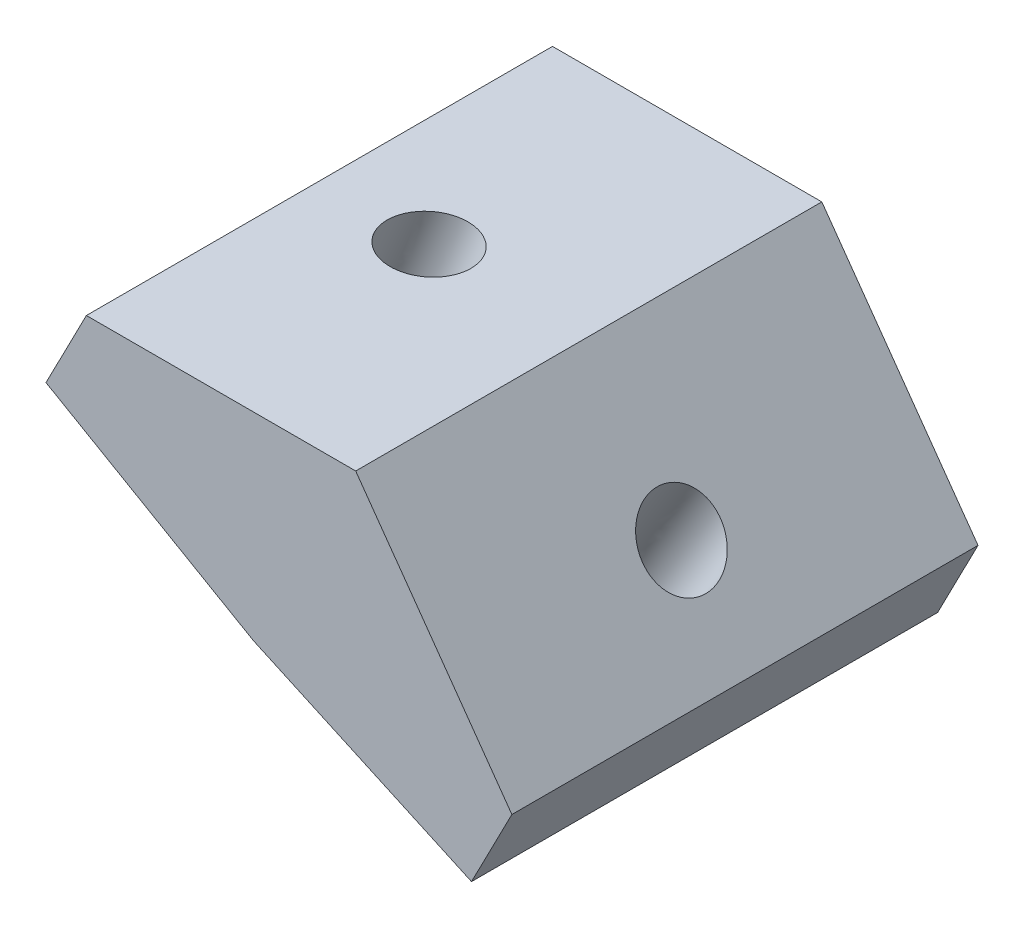
ISO-10303-21;
HEADER;
FILE_DESCRIPTION(('STEP AP214'),'2;1');
FILE_NAME('part.step','',(''),(''),'','','');
FILE_SCHEMA(('AUTOMOTIVE_DESIGN { 1 0 10303 214 1 1 1 1 }'));
ENDSEC;
DATA;
#1=APPLICATION_CONTEXT('core data for automotive mechanical design processes');
#2=APPLICATION_PROTOCOL_DEFINITION('international standard','automotive_design',2000,#1);
#3=PRODUCT_CONTEXT('',#1,'mechanical');
#4=PRODUCT('Part','Part','',(#3));
#5=PRODUCT_RELATED_PRODUCT_CATEGORY('part','',(#4));
#6=PRODUCT_DEFINITION_FORMATION('','',#4);
#7=PRODUCT_DEFINITION_CONTEXT('part definition',#1,'design');
#8=PRODUCT_DEFINITION('design','',#6,#7);
#9=PRODUCT_DEFINITION_SHAPE('','',#8);
#10=(LENGTH_UNIT() NAMED_UNIT(*) SI_UNIT(.MILLI.,.METRE.));
#11=(NAMED_UNIT(*) PLANE_ANGLE_UNIT() SI_UNIT($,.RADIAN.));
#12=(NAMED_UNIT(*) SI_UNIT($,.STERADIAN.) SOLID_ANGLE_UNIT());
#13=UNCERTAINTY_MEASURE_WITH_UNIT(LENGTH_MEASURE(1.E-05),#10,'distance_accuracy_value','');
#14=(GEOMETRIC_REPRESENTATION_CONTEXT(3) GLOBAL_UNCERTAINTY_ASSIGNED_CONTEXT((#13)) GLOBAL_UNIT_ASSIGNED_CONTEXT((#10,
#11,#12)) REPRESENTATION_CONTEXT('',''));
#15=CARTESIAN_POINT('',(0.,0.,0.));
#16=DIRECTION('',(0.,0.,1.));
#17=DIRECTION('',(1.,0.,0.));
#18=AXIS2_PLACEMENT_3D('',#15,#16,#17);
#19=CARTESIAN_POINT('',(0.835256512918846,-2.52045522789622,7.5));
#20=DIRECTION('',(0.5,0.866025403784438,0.));
#21=DIRECTION('',(-0.866025403784439,0.5,0.));
#22=AXIS2_PLACEMENT_3D('',#19,#20,#21);
#23=PLANE('',#22);
#24=DIRECTION('',(0.866025403784439,-0.5,0.));
#25=VECTOR('',#24,1.);
#26=CARTESIAN_POINT('',(0.835256512918846,-2.52045522789622,-7.5));
#27=LINE('',#26,#25);
#28=CARTESIAN_POINT('',(0.835256512918846,-2.52045522789622,-7.5));
#29=VERTEX_POINT('',#28);
#30=CARTESIAN_POINT('',(7.51412157971769,-6.37649977209372,-7.5));
#31=VERTEX_POINT('',#30);
#32=EDGE_CURVE('E143',#29,#31,#27,.T.);
#33=ORIENTED_EDGE('',*,*,#32,.T.);
#34=DIRECTION('',(0.,0.,-1.));
#35=VECTOR('',#34,1.);
#36=CARTESIAN_POINT('',(7.51412157971769,-6.37649977209372,7.5));
#37=LINE('',#36,#35);
#38=CARTESIAN_POINT('',(7.51412157971769,-6.37649977209372,7.5));
#39=VERTEX_POINT('',#38);
#40=EDGE_CURVE('E140',#39,#31,#37,.T.);
#41=ORIENTED_EDGE('',*,*,#40,.F.);
#42=DIRECTION('',(0.866025403784439,-0.5,0.));
#43=VECTOR('',#42,1.);
#44=CARTESIAN_POINT('',(0.835256512918846,-2.52045522789622,7.5));
#45=LINE('',#44,#43);
#46=CARTESIAN_POINT('',(0.835256512918846,-2.52045522789622,7.5));
#47=VERTEX_POINT('',#46);
#48=EDGE_CURVE('E85',#47,#39,#45,.T.);
#49=ORIENTED_EDGE('',*,*,#48,.F.);
#50=DIRECTION('',(0.,0.,-1.));
#51=VECTOR('',#50,1.);
#52=CARTESIAN_POINT('',(0.835256512918846,-2.52045522789622,7.5));
#53=LINE('',#52,#51);
#54=EDGE_CURVE('E52',#47,#29,#53,.T.);
#55=ORIENTED_EDGE('',*,*,#54,.T.);
#56=EDGE_LOOP('',(#33,#41,#49,#55));
#57=FACE_BOUND('',#56,.T.);
#58=CARTESIAN_POINT('',(4.92657752711901,-4.88258051678586,0.));
#59=CARTESIAN_POINT('',(4.92657459785399,-4.88257882557391,0.069236049147885));
#60=CARTESIAN_POINT('',(4.92157747601268,-4.87969373593366,0.138544782789752));
#61=CARTESIAN_POINT('',(4.90171986659104,-4.86822893978862,0.275212517791075));
#62=CARTESIAN_POINT('',(4.88685937900142,-4.85964923327845,0.342571519148693));
#63=CARTESIAN_POINT('',(4.84768834465895,-4.83703382605639,0.473531081509153));
#64=CARTESIAN_POINT('',(4.82337780026046,-4.82299812670378,0.537131643448353));
#65=CARTESIAN_POINT('',(4.76597625894126,-4.78985733137124,0.658806955690415));
#66=CARTESIAN_POINT('',(4.73288526564956,-4.77075223748652,0.716881708277103));
#67=CARTESIAN_POINT('',(4.65883577671832,-4.72799974511871,0.825907151696575));
#68=CARTESIAN_POINT('',(4.61787728483749,-4.70435234880571,0.876857845932858));
#69=CARTESIAN_POINT('',(4.52922243145101,-4.65316744533806,0.97022894363672));
#70=CARTESIAN_POINT('',(4.48152607324592,-4.62562994008899,1.01264935128285));
#71=CARTESIAN_POINT('',(4.38071103980372,-4.56742435339278,1.0877901267426));
#72=CARTESIAN_POINT('',(4.32759236699735,-4.53675627334902,1.12051049890456));
#73=CARTESIAN_POINT('',(4.21739778480917,-4.47313540165944,1.17534867469814));
#74=CARTESIAN_POINT('',(4.16032187684246,-4.44018261083063,1.19746648212118));
#75=CARTESIAN_POINT('',(4.04378705215817,-4.37290119842919,1.23048951778945));
#76=CARTESIAN_POINT('',(3.98432813598327,-4.33857257716988,1.24139474858811));
#77=CARTESIAN_POINT('',(3.86466724420144,-4.26948632908816,1.25169185177927));
#78=CARTESIAN_POINT('',(3.80446526864868,-4.23472870229703,1.25108372501126));
#79=CARTESIAN_POINT('',(3.68497870630409,-4.16574310336284,1.23837088949852));
#80=CARTESIAN_POINT('',(3.62569411951185,-4.13151513121955,1.22626618075885));
#81=CARTESIAN_POINT('',(3.50967748363781,-4.06453289526719,1.19089404721105));
#82=CARTESIAN_POINT('',(3.4529454345521,-4.03177863145588,1.16762662242002));
#83=CARTESIAN_POINT('',(3.3435986190565,-3.96864721809446,1.11057080716508));
#84=CARTESIAN_POINT('',(3.29098385263652,-3.93827006853854,1.07678241672701));
#85=CARTESIAN_POINT('',(3.19132278510372,-3.88073072437075,0.999616602972544));
#86=CARTESIAN_POINT('',(3.1442764839736,-3.8535685297489,0.956239179685968));
#87=CARTESIAN_POINT('',(3.05704994179581,-3.80320826214207,0.861091710242493));
#88=CARTESIAN_POINT('',(3.01686970072464,-3.78001018914353,0.809321664114321));
#89=CARTESIAN_POINT('',(2.94448349680374,-3.73821799482418,0.698816836353924));
#90=CARTESIAN_POINT('',(2.9122775339272,-3.7196238734879,0.640082054745111));
#91=CARTESIAN_POINT('',(2.85672816284329,-3.68755242913929,0.517267736960812));
#92=CARTESIAN_POINT('',(2.83338475460993,-3.67407510611196,0.453188200800995));
#93=CARTESIAN_POINT('',(2.79620432901109,-3.65260897738389,0.321451767099531));
#94=CARTESIAN_POINT('',(2.78236731162488,-3.64462017167118,0.253794869565684));
#95=CARTESIAN_POINT('',(2.76458130700988,-3.6343514171189,0.116769772117517));
#96=CARTESIAN_POINT('',(2.76063231976932,-3.63207146827252,0.0474015722052339));
#97=CARTESIAN_POINT('',(2.762731292531,-3.6332833107615,-0.0911328723644653));
#98=CARTESIAN_POINT('',(2.76877925253255,-3.63677510209645,-0.160299117021896));
#99=CARTESIAN_POINT('',(2.79070531083519,-3.64943411775975,-0.296521963484243));
#100=CARTESIAN_POINT('',(2.80658340914668,-3.6586013420941,-0.363578565286928));
#101=CARTESIAN_POINT('',(2.84773180953224,-3.68235838213343,-0.493732623558346));
#102=CARTESIAN_POINT('',(2.87300211162575,-3.69694819784963,-0.556830080018884));
#103=CARTESIAN_POINT('',(2.93223793734297,-3.73114801777314,-0.677325540871201));
#104=CARTESIAN_POINT('',(2.9662034609915,-3.75075802199478,-0.734723545246706));
#105=CARTESIAN_POINT('',(3.04189292234704,-3.79445735288321,-0.842236990429858));
#106=CARTESIAN_POINT('',(3.08361686007985,-3.8185466795649,-0.892352431213268));
#107=CARTESIAN_POINT('',(3.17367235401916,-3.87054024323277,-0.983918497506417));
#108=CARTESIAN_POINT('',(3.22200391024836,-3.89844448023206,-1.02536912298638));
#109=CARTESIAN_POINT('',(3.32394159695831,-3.95729823109462,-1.0984622919765));
#110=CARTESIAN_POINT('',(3.37754772745576,-3.98824774496753,-1.13010483545558));
#111=CARTESIAN_POINT('',(3.48855603646903,-4.05233842205862,-1.18270909288414));
#112=CARTESIAN_POINT('',(3.54595821499453,-4.08547958528239,-1.20367080680635));
#113=CARTESIAN_POINT('',(3.66297539167371,-4.15303948373792,-1.23433524955404));
#114=CARTESIAN_POINT('',(3.72259038983105,-4.18745821897179,-1.24403797836085));
#115=CARTESIAN_POINT('',(3.84238894333975,-4.25662394608857,-1.25191683494979));
#116=CARTESIAN_POINT('',(3.90257249869144,-4.29137093797167,-1.25009296272524));
#117=CARTESIAN_POINT('',(4.02184822248344,-4.36023480921077,-1.23496892188799));
#118=CARTESIAN_POINT('',(4.08094039092436,-4.39435168856712,-1.22166875328172));
#119=CARTESIAN_POINT('',(4.19640349833081,-4.4610143447097,-1.18395896049842));
#120=CARTESIAN_POINT('',(4.2527744373008,-4.4935601214985,-1.15954933633959));
#121=CARTESIAN_POINT('',(4.36124030418795,-4.5561829189437,-1.10029387881344));
#122=CARTESIAN_POINT('',(4.41333523211597,-4.58625993960635,-1.06544804547261));
#123=CARTESIAN_POINT('',(4.511812220155,-4.64311565515967,-0.986281295689677));
#124=CARTESIAN_POINT('',(4.55819428028407,-4.66989435006075,-0.941960379277515));
#125=CARTESIAN_POINT('',(4.64396630436848,-4.71941485125483,-0.845065792742799));
#126=CARTESIAN_POINT('',(4.68335626834784,-4.74215665756169,-0.792492122648587));
#127=CARTESIAN_POINT('',(4.75405750894611,-4.78297603785314,-0.680542466029425));
#128=CARTESIAN_POINT('',(4.78536878559195,-4.80105361185327,-0.621166479527147));
#129=CARTESIAN_POINT('',(4.8390496863226,-4.83204629434045,-0.497248418404004));
#130=CARTESIAN_POINT('',(4.86141931043305,-4.8449614028423,-0.432706343797948));
#131=CARTESIAN_POINT('',(4.89457584855249,-4.86410433905095,-0.307854433370322));
#132=CARTESIAN_POINT('',(4.90639855583487,-4.87093018228298,-0.247910832774399));
#133=CARTESIAN_POINT('',(4.91840955635714,-4.87786473666776,-0.156424994979692));
#134=CARTESIAN_POINT('',(4.92146007323046,-4.87962595340575,-0.12535415145895));
#135=CARTESIAN_POINT('',(4.92555048173594,-4.88198755185748,-0.0628611958611198));
#136=CARTESIAN_POINT('',(4.92657885721368,-4.88258128471638,-0.0314380909964967));
#137=CARTESIAN_POINT('',(4.92657752711901,-4.88258051678586,0.));
#138=B_SPLINE_CURVE_WITH_KNOTS('',3,(#58,#59,#60,#61,#62,#63,#64,#65,#66,#67,#68,#69,#70,#71,
#72,#73,#74,#75,#76,#77,#78,#79,#80,#81,#82,#83,#84,#85,#86,#87,#88,#89,#90,#91,#92,#93,#94,#95,
#96,#97,#98,#99,#100,#101,#102,#103,#104,#105,#106,#107,#108,#109,#110,#111,#112,#113,#114,#115,
#116,#117,#118,#119,#120,#121,#122,#123,#124,#125,#126,#127,#128,#129,#130,#131,#132,#133,#134,
#135,#136,#137),.UNSPECIFIED.,.T.,.F.,(4,2,2,2,2,2,2,2,2,2,2,2,2,2,2,2,2,2,2,2,2,2,2,2,2,2,2,2,
2,2,2,2,2,2,2,2,2,2,2,4),(0.,0.207595609090906,0.41519121837749,0.622786775944459,
0.830382247711446,1.03797762029992,1.24557289119783,1.45316806903482,1.66076317263668,
1.86835822896272,2.07595327015199,2.28354831124969,2.49114335202932,2.69873839229924,
2.90633343192364,3.11392847083744,3.32152350905341,3.52911854666081,3.73671358381553,
3.94430862072309,4.15190365761608,4.35949869472868,4.56709373227102,4.77468877040614,
4.98228380923214,5.1898788487714,5.39747388896819,5.60506892969472,5.81266397076513,
6.02025901195594,6.22785405303043,6.43544909376465,6.64304413397192,6.8506391735233,
7.05823421236172,7.26582925050822,7.47342428805963,7.65715815108702,7.75088905193434,
7.84515222450688),.UNSPECIFIED.);
#139=CARTESIAN_POINT('',(4.92657752711901,-4.88258051678586,0.));
#140=VERTEX_POINT('',#139);
#141=EDGE_CURVE('E158',#140,#140,#138,.T.);
#142=ORIENTED_EDGE('',*,*,#141,.F.);
#143=EDGE_LOOP('',(#142));
#144=FACE_BOUND('',#143,.T.);
#145=ADVANCED_FACE('F38',(#57,#144),#23,.F.);
#146=CARTESIAN_POINT('',(10.8020588900131,0.,7.5));
#147=DIRECTION('',(0.,-1.,0.));
#148=DIRECTION('',(1.,0.,0.));
#149=AXIS2_PLACEMENT_3D('',#146,#147,#148);
#150=PLANE('',#149);
#151=DIRECTION('',(-1.,0.,0.));
#152=VECTOR('',#151,1.);
#153=CARTESIAN_POINT('',(10.8020588900131,0.,-7.5));
#154=LINE('',#153,#152);
#155=CARTESIAN_POINT('',(10.8020588900131,0.,-7.5));
#156=VERTEX_POINT('',#155);
#157=CARTESIAN_POINT('',(2.13494701619964,0.,-7.5));
#158=VERTEX_POINT('',#157);
#159=EDGE_CURVE('E75',#156,#158,#154,.T.);
#160=ORIENTED_EDGE('',*,*,#159,.T.);
#161=DIRECTION('',(0.,0.,-1.));
#162=VECTOR('',#161,1.);
#163=CARTESIAN_POINT('',(2.13494701619964,0.,7.5));
#164=LINE('',#163,#162);
#165=CARTESIAN_POINT('',(2.13494701619964,0.,7.5));
#166=VERTEX_POINT('',#165);
#167=EDGE_CURVE('E11',#166,#158,#164,.T.);
#168=ORIENTED_EDGE('',*,*,#167,.F.);
#169=DIRECTION('',(-1.,0.,0.));
#170=VECTOR('',#169,1.);
#171=CARTESIAN_POINT('',(10.8020588900131,0.,7.5));
#172=LINE('',#171,#170);
#173=CARTESIAN_POINT('',(10.8020588900131,0.,7.5));
#174=VERTEX_POINT('',#173);
#175=EDGE_CURVE('E145',#174,#166,#172,.T.);
#176=ORIENTED_EDGE('',*,*,#175,.F.);
#177=DIRECTION('',(0.,0.,-1.));
#178=VECTOR('',#177,1.);
#179=CARTESIAN_POINT('',(10.8020588900131,0.,7.5));
#180=LINE('',#179,#178);
#181=EDGE_CURVE('E123',#174,#156,#180,.T.);
#182=ORIENTED_EDGE('',*,*,#181,.T.);
#183=EDGE_LOOP('',(#160,#168,#176,#182));
#184=FACE_BOUND('',#183,.T.);
#185=CARTESIAN_POINT('',(7.01043800882437,0.,0.));
#186=CARTESIAN_POINT('',(7.01044054819399,0.,-0.0326197766176478));
#187=CARTESIAN_POINT('',(7.00906255764425,0.,-0.0652248093734754));
#188=CARTESIAN_POINT('',(7.00085607410857,0.,-0.162058435536137));
#189=CARTESIAN_POINT('',(6.99001252618542,1.09673512400053E-13,-0.225999587916245));
#190=CARTESIAN_POINT('',(6.95774279417696,-1.14505847398037E-13,-0.352027523267987));
#191=CARTESIAN_POINT('',(6.93617448491976,-4.11317868254406E-13,-0.414077187946057));
#192=CARTESIAN_POINT('',(6.8831922971431,4.14613606297808E-13,-0.533848168856928));
#193=CARTESIAN_POINT('',(6.85177794850153,1.53742489270096E-12,-0.591569278249641));
#194=CARTESIAN_POINT('',(6.79785762784148,8.69662442261407E-13,-0.674260504686171));
#195=CARTESIAN_POINT('',(6.77856367356384,2.39913269984359E-13,-0.701382114641422));
#196=CARTESIAN_POINT('',(6.73789331252337,-2.36661919519021E-13,-0.754004576246216));
#197=CARTESIAN_POINT('',(6.71651751448721,0.,-0.779505898082326));
#198=CARTESIAN_POINT('',(6.64899932795825,1.64479084916056E-13,-0.853942466758333));
#199=CARTESIAN_POINT('',(6.59986127966756,0.,-0.900207963619328));
#200=CARTESIAN_POINT('',(6.49511529273198,0.,-0.984756828914616));
#201=CARTESIAN_POINT('',(6.4395027753707,0.,-1.02303449431064));
#202=CARTESIAN_POINT('',(6.34975008185302,0.,-1.07552705893432));
#203=CARTESIAN_POINT('',(6.31734315239558,0.,-1.0927697847323));
#204=CARTESIAN_POINT('',(6.25130167136348,0.,-1.12462731840507));
#205=CARTESIAN_POINT('',(6.21766829173973,0.,-1.139244559832));
#206=CARTESIAN_POINT('',(6.11520510664441,0.,-1.17909650466516));
#207=CARTESIAN_POINT('',(6.0447813032775,0.,-1.2003494008346));
#208=CARTESIAN_POINT('',(5.90157025176746,0.,-1.23188886326215));
#209=CARTESIAN_POINT('',(5.8287832490702,0.,-1.24217656465317));
#210=CARTESIAN_POINT('',(5.68248678820776,0.,-1.25168768497707));
#211=CARTESIAN_POINT('',(5.60897735813558,0.,-1.2509115324614));
#212=CARTESIAN_POINT('',(5.46291005718404,0.,-1.23829967470828));
#213=CARTESIAN_POINT('',(5.39035221130398,0.,-1.22646367950286));
#214=CARTESIAN_POINT('',(5.24787015497947,0.,-1.19187098860697));
#215=CARTESIAN_POINT('',(5.17794618503118,0.,-1.1691132982635));
#216=CARTESIAN_POINT('',(5.04247238555269,0.,-1.11297172554038));
#217=CARTESIAN_POINT('',(4.97692323583688,0.,-1.07958619630298));
#218=CARTESIAN_POINT('',(4.85200768873798,0.,-1.0026963405394));
#219=CARTESIAN_POINT('',(4.79264262394703,0.,-0.959189839575155));
#220=CARTESIAN_POINT('',(4.68344843048274,0.,-0.864151895551853));
#221=CARTESIAN_POINT('',(4.63340796196168,0.,-0.812864194408289));
#222=CARTESIAN_POINT('',(4.54430713208672,0.,-0.704564659765058));
#223=CARTESIAN_POINT('',(4.5049169581411,0.,-0.647824574789502));
#224=CARTESIAN_POINT('',(4.43728499064726,0.,-0.530310352112407));
#225=CARTESIAN_POINT('',(4.40873777323097,0.,-0.469713789593103));
#226=CARTESIAN_POINT('',(4.37412313320883,0.,-0.376661216173681));
#227=CARTESIAN_POINT('',(4.3640243906467,0.,-0.345656373396261));
#228=CARTESIAN_POINT('',(4.34642314411828,0.,-0.282885357862984));
#229=CARTESIAN_POINT('',(4.33892315966935,0.,-0.25111847802433));
#230=CARTESIAN_POINT('',(4.32045419296144,0.,-0.154978956552985));
#231=CARTESIAN_POINT('',(4.31352247191216,0.,-0.0897842658632509));
#232=CARTESIAN_POINT('',(4.31076212559927,0.,0.0408269050709526));
#233=CARTESIAN_POINT('',(4.31493100987414,0.,0.106243332279321));
#234=CARTESIAN_POINT('',(4.32927227144576,0.,0.202605784035357));
#235=CARTESIAN_POINT('',(4.33532880183093,0.,0.234211616626433));
#236=CARTESIAN_POINT('',(4.35001785942137,0.,0.296814443716418));
#237=CARTESIAN_POINT('',(4.35865002630192,0.,0.327811522732274));
#238=CARTESIAN_POINT('',(4.38855822893718,0.,0.420372585397124));
#239=CARTESIAN_POINT('',(4.41372795947334,1.92488769548184E-13,0.480720274927505));
#240=CARTESIAN_POINT('',(4.47344839732521,-1.90830026838442E-13,0.596586917267668));
#241=CARTESIAN_POINT('',(4.50800323116591,-7.2444701221979E-13,0.652103731784437));
#242=CARTESIAN_POINT('',(4.56655860907075,-4.16536403817117E-13,0.731608335063845));
#243=CARTESIAN_POINT('',(4.5875694852955,-1.15698285605339E-13,0.75784785554381));
#244=CARTESIAN_POINT('',(4.63159158912477,1.17506026934347E-13,0.808575764879459));
#245=CARTESIAN_POINT('',(4.65460215278263,0.,0.833064730078932));
#246=CARTESIAN_POINT('',(4.72692361689257,0.,0.904260437693111));
#247=CARTESIAN_POINT('',(4.77909315828735,0.,0.948114031302385));
#248=CARTESIAN_POINT('',(4.88948628418317,0.,1.0274322510772));
#249=CARTESIAN_POINT('',(4.94771414713594,0.,1.06289088995281));
#250=CARTESIAN_POINT('',(5.04124940259958,0.,1.11081365173438));
#251=CARTESIAN_POINT('',(5.07498508344348,0.,1.12641608173563));
#252=CARTESIAN_POINT('',(5.1435517132156,0.,1.15488831872107));
#253=CARTESIAN_POINT('',(5.17838161801383,0.,1.16776064503383));
#254=CARTESIAN_POINT('',(5.28423107661437,0.,1.20223005659465));
#255=CARTESIAN_POINT('',(5.35664196393213,0.,1.21969564224735));
#256=CARTESIAN_POINT('',(5.50323746063666,0.,1.24332268312812));
#257=CARTESIAN_POINT('',(5.57742192310736,0.,1.249485071405));
#258=CARTESIAN_POINT('',(5.72587236862648,0.,1.2504527836185));
#259=CARTESIAN_POINT('',(5.80013835049488,0.,1.24525826983731));
#260=CARTESIAN_POINT('',(5.9470097646098,0.,1.22356811820798));
#261=CARTESIAN_POINT('',(6.01961510694277,0.,1.2070718699294));
#262=CARTESIAN_POINT('',(6.16139905229285,0.,1.16298324032526));
#263=CARTESIAN_POINT('',(6.23057723602677,0.,1.13538950506509));
#264=CARTESIAN_POINT('',(6.36367078481235,0.,1.06949451590444));
#265=CARTESIAN_POINT('',(6.42758515727872,0.,1.03119124848855));
#266=CARTESIAN_POINT('',(6.54715704660554,0.,0.945304256205315));
#267=CARTESIAN_POINT('',(6.6029406724836,0.,0.897896771346826));
#268=CARTESIAN_POINT('',(6.70381290902615,0.,0.796273840062661));
#269=CARTESIAN_POINT('',(6.7492229337141,0.,0.742378448356902));
#270=CARTESIAN_POINT('',(6.82895082538313,0.,0.629643753646386));
#271=CARTESIAN_POINT('',(6.86359273911601,0.,0.571034209881929));
#272=CARTESIAN_POINT('',(6.92172678796297,0.,0.450486778434005));
#273=CARTESIAN_POINT('',(6.94550016870439,0.,0.388685328804073));
#274=CARTESIAN_POINT('',(6.97929742649733,0.,0.272555925006091));
#275=CARTESIAN_POINT('',(6.99095114050799,0.,0.218696002311917));
#276=CARTESIAN_POINT('',(7.00651653729136,0.,0.109876248912171));
#277=CARTESIAN_POINT('',(7.0104337336527,0.,0.0549172297371514));
#278=CARTESIAN_POINT('',(7.01043800882437,0.,0.));
#279=B_SPLINE_CURVE_WITH_KNOTS('',3,(#185,#186,#187,#188,#189,#190,#191,#192,#193,#194,#195,
#196,#197,#198,#199,#200,#201,#202,#203,#204,#205,#206,#207,#208,#209,#210,#211,#212,#213,#214,
#215,#216,#217,#218,#219,#220,#221,#222,#223,#224,#225,#226,#227,#228,#229,#230,#231,#232,#233,
#234,#235,#236,#237,#238,#239,#240,#241,#242,#243,#244,#245,#246,#247,#248,#249,#250,#251,#252,
#253,#254,#255,#256,#257,#258,#259,#260,#261,#262,#263,#264,#265,#266,#267,#268,#269,#270,#271,
#272,#273,#274,#275,#276,#277,#278),.UNSPECIFIED.,.T.,.F.,(4,2,2,2,2,2,2,2,2,2,2,2,2,2,2,2,2,2,
2,2,2,2,2,2,2,2,2,2,2,2,2,2,2,2,2,2,2,2,2,2,2,2,2,2,2,2,4),(0.,0.0978185092397389,
0.291391946155555,0.487601875734675,0.683821175242134,0.783583955664388,0.883317652743099,
1.08492179772966,1.28666939240235,1.39669125751791,1.50661061149766,1.72634312666506,
1.94605289259265,2.16575414822293,2.38546116416243,2.6051881929041,2.8249492864683,
3.04475763823455,3.2587298259897,3.46501695335542,3.66496413094561,3.76269124694923,
3.8605128468202,4.05620925729957,4.25186176627088,4.3483094953913,4.44474373805117,
4.63996767897243,4.83527759702904,4.93602965131194,5.03674838025528,5.24033425932006,
5.444064901559,5.55546594859556,5.66676374356309,5.88925418669576,6.11172626300876,
6.33419516037215,6.55667607469584,6.77918414075544,7.00173406905774,7.22034536827893,
7.43079908090713,7.63411294236747,7.8318175297525,7.9966179860451,8.16130095145703),.UNSPECIFIED.);
#280=CARTESIAN_POINT('',(7.01043800882437,0.,0.));
#281=VERTEX_POINT('',#280);
#282=EDGE_CURVE('E42',#281,#281,#279,.T.);
#283=ORIENTED_EDGE('',*,*,#282,.F.);
#284=EDGE_LOOP('',(#283));
#285=FACE_BOUND('',#284,.T.);
#286=ADVANCED_FACE('F184',(#184,#285),#150,.F.);
#287=CARTESIAN_POINT('',(14.5287897666146,-9.58130059821036,7.5));
#288=DIRECTION('',(0.415555472633111,0.909567836483168,0.));
#289=DIRECTION('',(0.909567836483169,-0.415555472633111,0.));
#290=AXIS2_PLACEMENT_3D('',#287,#288,#289);
#291=PLANE('',#290);
#292=DIRECTION('',(-0.909567836483169,0.415555472633111,0.));
#293=VECTOR('',#292,1.);
#294=CARTESIAN_POINT('',(14.5287897666146,-9.58130059821036,-7.5));
#295=LINE('',#294,#293);
#296=CARTESIAN_POINT('',(14.5287897666146,-9.58130059821036,-7.5));
#297=VERTEX_POINT('',#296);
#298=EDGE_CURVE('E131',#297,#31,#295,.T.);
#299=ORIENTED_EDGE('',*,*,#298,.F.);
#300=DIRECTION('',(0.,0.,-1.));
#301=VECTOR('',#300,1.);
#302=CARTESIAN_POINT('',(14.5287897666146,-9.58130059821036,7.5));
#303=LINE('',#302,#301);
#304=CARTESIAN_POINT('',(14.5287897666146,-9.58130059821036,7.5));
#305=VERTEX_POINT('',#304);
#306=EDGE_CURVE('E114',#305,#297,#303,.T.);
#307=ORIENTED_EDGE('',*,*,#306,.F.);
#308=DIRECTION('',(-0.909567836483169,0.415555472633111,0.));
#309=VECTOR('',#308,1.);
#310=CARTESIAN_POINT('',(14.5287897666146,-9.58130059821036,7.5));
#311=LINE('',#310,#309);
#312=EDGE_CURVE('E110',#305,#39,#311,.T.);
#313=ORIENTED_EDGE('',*,*,#312,.T.);
#314=ORIENTED_EDGE('',*,*,#40,.T.);
#315=EDGE_LOOP('',(#299,#307,#313,#314));
#316=FACE_BOUND('',#315,.T.);
#317=CARTESIAN_POINT('',(12.5063406244485,-8.65730155664486,0.));
#318=CARTESIAN_POINT('',(12.5063375479652,-8.65730015108782,0.0692357461496735));
#319=CARTESIAN_POINT('',(12.5010891937276,-8.6549023284755,0.138544167989579));
#320=CARTESIAN_POINT('',(12.4802332432524,-8.64537384251841,0.275211268821659));
#321=CARTESIAN_POINT('',(12.464625649836,-8.6382431804626,0.342569948344829));
#322=CARTESIAN_POINT('',(12.4234853188798,-8.61944734249532,0.47352889825096));
#323=CARTESIAN_POINT('',(12.3979525814362,-8.60778216662784,0.537129168670377));
#324=CARTESIAN_POINT('',(12.3376652402501,-8.5802386085165,0.65880396066924));
#325=CARTESIAN_POINT('',(12.302910636634,-8.56436022633038,0.716878482324396));
#326=CARTESIAN_POINT('',(12.2251384147242,-8.52882832740305,0.825903557533905));
#327=CARTESIAN_POINT('',(12.1821207965644,-8.509174810723,0.876854111203679));
#328=CARTESIAN_POINT('',(12.089008965957,-8.4666346842764,0.970225055607179));
#329=CARTESIAN_POINT('',(12.0389147536293,-8.44374807456458,1.0126454464853));
#330=CARTESIAN_POINT('',(11.9330314121413,-8.3953730108792,1.08778634864452));
#331=CARTESIAN_POINT('',(11.8772422830709,-8.36988455694674,1.12050686007886));
#332=CARTESIAN_POINT('',(11.7615078205814,-8.3170087984484,1.17534549997049));
#333=CARTESIAN_POINT('',(11.7015624872161,-8.28962149390708,1.19746362856495));
#334=CARTESIAN_POINT('',(11.5791689549188,-8.23370339728913,1.23048750493104));
#335=CARTESIAN_POINT('',(11.5167207560084,-8.2051726052224,1.24139325279978));
#336=CARTESIAN_POINT('',(11.3910438525852,-8.1477544304516,1.25169158473183));
#337=CARTESIAN_POINT('',(11.3278151480751,-8.11886704774874,1.25108416883469));
#338=CARTESIAN_POINT('',(11.2023211180695,-8.06153242260058,1.2383729270132));
#339=CARTESIAN_POINT('',(11.1400557925763,-8.03308518015623,1.22626910106392));
#340=CARTESIAN_POINT('',(11.0182058376678,-7.97741542846612,1.19089885992206));
#341=CARTESIAN_POINT('',(10.9586212082727,-7.95019291922958,1.16763244464539));
#342=CARTESIAN_POINT('',(10.8437760354923,-7.89772345170869,1.1105787111673));
#343=CARTESIAN_POINT('',(10.7885154921591,-7.87247649344819,1.07679139283886));
#344=CARTESIAN_POINT('',(10.6838426312917,-7.82465446366117,0.999627712247005));
#345=CARTESIAN_POINT('',(10.6344303138469,-7.8020793921755,0.956251349836961));
#346=CARTESIAN_POINT('',(10.5428167574399,-7.76022378426447,0.861105918376574));
#347=CARTESIAN_POINT('',(10.500615518599,-7.74094324789455,0.809336849184967));
#348=CARTESIAN_POINT('',(10.4245880933376,-7.70620849654304,0.698833829932139));
#349=CARTESIAN_POINT('',(10.3907619070555,-7.69075428162468,0.640099879755793));
#350=CARTESIAN_POINT('',(10.3324175732965,-7.66409842791243,0.517287036083485));
#351=CARTESIAN_POINT('',(10.3078994259538,-7.65289678917982,0.453208142510471));
#352=CARTESIAN_POINT('',(10.2688474320881,-7.63505505256909,0.321472790383895));
#353=CARTESIAN_POINT('',(10.2543135845095,-7.62841495420869,0.253816332208571));
#354=CARTESIAN_POINT('',(10.2356310672515,-7.61987944758924,0.116791948000339));
#355=CARTESIAN_POINT('',(10.2314823902063,-7.61798403596495,0.0474240231813495));
#356=CARTESIAN_POINT('',(10.2336846221569,-7.61899017261844,-0.0911100788856956));
#357=CARTESIAN_POINT('',(10.2400355311565,-7.62189172089787,-0.160276256133681));
#358=CARTESIAN_POINT('',(10.2630617632875,-7.63241174633453,-0.296499165900727));
#359=CARTESIAN_POINT('',(10.2797370863653,-7.64003022346724,-0.363555898430758));
#360=CARTESIAN_POINT('',(10.3229522063548,-7.65977397307206,-0.493710409680139));
#361=CARTESIAN_POINT('',(10.3494920031661,-7.6718992454983,-0.556808188439785));
#362=CARTESIAN_POINT('',(10.411704052181,-7.7003221474468,-0.677304487226005));
#363=CARTESIAN_POINT('',(10.4473763042564,-7.71661977691046,-0.7347030073326));
#364=CARTESIAN_POINT('',(10.5268693631878,-7.75293787694688,-0.842217689268246));
#365=CARTESIAN_POINT('',(10.5706901699105,-7.77295834745871,-0.892333851216469));
#366=CARTESIAN_POINT('',(10.6652716985674,-7.81616993681673,-0.983901584479027));
#367=CARTESIAN_POINT('',(10.7160324203843,-7.83936105560936,-1.02535315593975));
#368=CARTESIAN_POINT('',(10.8230937409752,-7.88827430418122,-1.09844846164762));
#369=CARTESIAN_POINT('',(10.8793943396629,-7.91399643392104,-1.13009219604752));
#370=CARTESIAN_POINT('',(10.995982593644,-7.96726226527883,-1.18269909201024));
#371=CARTESIAN_POINT('',(11.0562702488874,-7.99480596687395,-1.20366225370708));
#372=CARTESIAN_POINT('',(11.1791698408621,-8.05095526765279,-1.23432984340284));
#373=CARTESIAN_POINT('',(11.2417817775744,-8.07956086682787,-1.24403427149348));
#374=CARTESIAN_POINT('',(11.3676030595212,-8.13704500400762,-1.25191674868325));
#375=CARTESIAN_POINT('',(11.4308124047539,-8.16592354201153,-1.25009479781526));
#376=CARTESIAN_POINT('',(11.5560851562447,-8.223157071349,-1.23497476551527));
#377=CARTESIAN_POINT('',(11.6181485624995,-8.25151206268113,-1.22167668405166));
#378=CARTESIAN_POINT('',(11.7394176892844,-8.30691645065041,-1.1839711505144));
#379=CARTESIAN_POINT('',(11.7986234097913,-8.33396584727703,-1.15956369835122));
#380=CARTESIAN_POINT('',(11.912544230785,-8.38601300496217,-1.100312571348));
#381=CARTESIAN_POINT('',(11.9672593312156,-8.41101076599509,-1.06546889637769));
#382=CARTESIAN_POINT('',(12.0706898044502,-8.45826518448447,-0.9863063439407));
#383=CARTESIAN_POINT('',(12.1194051771609,-8.48052184189835,-0.94198746632681));
#384=CARTESIAN_POINT('',(12.2094926134712,-8.52168020928188,-0.845096737706704));
#385=CARTESIAN_POINT('',(12.2508646769468,-8.54058191919487,-0.792524886561115));
#386=CARTESIAN_POINT('',(12.3251242131887,-8.57450897272818,-0.680578559046206));
#387=CARTESIAN_POINT('',(12.358011685816,-8.58953431628496,-0.621204082565391));
#388=CARTESIAN_POINT('',(12.4143956112985,-8.61529451564885,-0.497288681378126));
#389=CARTESIAN_POINT('',(12.4378920640213,-8.62602937139548,-0.432747756598847));
#390=CARTESIAN_POINT('',(12.4727217236067,-8.64194204450255,-0.307890620803673));
#391=CARTESIAN_POINT('',(12.485141851524,-8.64761644493736,-0.247940377603053));
#392=CARTESIAN_POINT('',(12.4977598367521,-8.6533812407061,-0.156444008608397));
#393=CARTESIAN_POINT('',(12.5009645262217,-8.65484537146553,-0.125369443894474));
#394=CARTESIAN_POINT('',(12.5052616692667,-8.65680861294949,-0.0628689111163));
#395=CARTESIAN_POINT('',(12.5063420215683,-8.65730219494885,-0.0314419496213436));
#396=CARTESIAN_POINT('',(12.5063406244485,-8.65730155664486,0.));
#397=B_SPLINE_CURVE_WITH_KNOTS('',3,(#317,#318,#319,#320,#321,#322,#323,#324,#325,#326,#327,
#328,#329,#330,#331,#332,#333,#334,#335,#336,#337,#338,#339,#340,#341,#342,#343,#344,#345,#346,
#347,#348,#349,#350,#351,#352,#353,#354,#355,#356,#357,#358,#359,#360,#361,#362,#363,#364,#365,
#366,#367,#368,#369,#370,#371,#372,#373,#374,#375,#376,#377,#378,#379,#380,#381,#382,#383,#384,
#385,#386,#387,#388,#389,#390,#391,#392,#393,#394,#395,#396),.UNSPECIFIED.,.T.,.F.,(4,2,2,2,2,2,
2,2,2,2,2,2,2,2,2,2,2,2,2,2,2,2,2,2,2,2,2,2,2,2,2,2,2,2,2,2,2,2,2,4),(0.,0.207594685304513,
0.415189314071953,0.622783940825825,0.830378564735393,1.03797318528157,1.24556780231377,
1.45316241606641,1.66075702713322,1.8683516364022,2.0759462449583,2.28354085396455,
2.49113546453471,2.69873007761117,2.90632469386173,3.11391931360646,3.3215139367826,
3.52910856295139,3.73670316717241,3.94429762415394,4.15189208120725,4.35948653718077,
4.56708099104122,4.77467544198687,4.98226988953535,5.1898643335765,5.39745877438444,
5.60505321258749,5.8126476490994,6.02024208501917,6.22783652151067,6.43543095967516,
6.64302540043057,6.85061984441101,7.05821429189725,7.26580874278594,7.47340319660095,
7.65715841084024,7.75090067331227,7.84517540854641),.UNSPECIFIED.);
#398=CARTESIAN_POINT('',(12.5063406244485,-8.65730155664486,0.));
#399=VERTEX_POINT('',#398);
#400=EDGE_CURVE('E135',#399,#399,#397,.T.);
#401=ORIENTED_EDGE('',*,*,#400,.F.);
#402=EDGE_LOOP('',(#401));
#403=FACE_BOUND('',#402,.T.);
#404=ADVANCED_FACE('F180',(#316,#403),#291,.F.);
#405=CARTESIAN_POINT('',(10.8020588900131,0.,7.5));
#406=DIRECTION('',(-0.814665514223508,-0.579931116543119,0.));
#407=DIRECTION('',(-0.579931116543119,0.814665514223507,0.));
#408=AXIS2_PLACEMENT_3D('',#405,#406,#407);
#409=PLANE('',#408);
#410=DIRECTION('',(0.579931116543119,-0.814665514223507,0.));
#411=VECTOR('',#410,1.);
#412=CARTESIAN_POINT('',(10.8020588900131,0.,-7.5));
#413=LINE('',#412,#411);
#414=CARTESIAN_POINT('',(15.8283867561979,-7.06079715151291,-7.5));
#415=VERTEX_POINT('',#414);
#416=EDGE_CURVE('E134',#156,#415,#413,.T.);
#417=ORIENTED_EDGE('',*,*,#416,.F.);
#418=ORIENTED_EDGE('',*,*,#181,.F.);
#419=DIRECTION('',(0.579931116543119,-0.814665514223507,0.));
#420=VECTOR('',#419,1.);
#421=CARTESIAN_POINT('',(10.8020588900131,0.,7.5));
#422=LINE('',#421,#420);
#423=CARTESIAN_POINT('',(15.8283867561979,-7.06079715151291,7.5));
#424=VERTEX_POINT('',#423);
#425=EDGE_CURVE('E107',#174,#424,#422,.T.);
#426=ORIENTED_EDGE('',*,*,#425,.T.);
#427=DIRECTION('',(0.,0.,-1.));
#428=VECTOR('',#427,1.);
#429=CARTESIAN_POINT('',(15.8283867561979,-7.06079715151291,7.5));
#430=LINE('',#429,#428);
#431=EDGE_CURVE('E117',#424,#415,#430,.T.);
#432=ORIENTED_EDGE('',*,*,#431,.T.);
#433=EDGE_LOOP('',(#417,#418,#426,#432));
#434=FACE_BOUND('',#433,.T.);
#435=CARTESIAN_POINT('',(14.5664509476353,-5.2880769868703,0.));
#436=CARTESIAN_POINT('',(14.5664524764877,-5.28807913454488,-0.0326203617373066));
#437=CARTESIAN_POINT('',(14.5656532955656,-5.28695647511473,-0.0652255071464656));
#438=CARTESIAN_POINT('',(14.5608940064306,-5.28027080397231,-0.162059871702767));
#439=CARTESIAN_POINT('',(14.5546054643984,-5.27143689563019,-0.226001902140085));
#440=CARTESIAN_POINT('',(14.5358912251038,-5.24514783311301,-0.352030349916658));
#441=CARTESIAN_POINT('',(14.5233832045361,-5.22757703424159,-0.414079691471492));
#442=CARTESIAN_POINT('',(14.4926570001201,-5.18441401296924,-0.533852160149671));
#443=CARTESIAN_POINT('',(14.4744383554833,-5.15882114326974,-0.591574937697923));
#444=CARTESIAN_POINT('',(14.4431675447778,-5.11489307947469,-0.674267902884764));
#445=CARTESIAN_POINT('',(14.4319782505808,-5.09917477802234,-0.701389739281654));
#446=CARTESIAN_POINT('',(14.4083920197078,-5.06604172419034,-0.754012493717656));
#447=CARTESIAN_POINT('',(14.3959954419271,-5.04862747597355,-0.779513889770866));
#448=CARTESIAN_POINT('',(14.3568391997709,-4.9936222533858,-0.8539507671068));
#449=CARTESIAN_POINT('',(14.3283422305077,-4.95359077817003,-0.900216443215545));
#450=CARTESIAN_POINT('',(14.2675961155055,-4.86825691074384,-0.984765494536755));
#451=CARTESIAN_POINT('',(14.2353443118111,-4.82295078473723,-1.02304316104916));
#452=CARTESIAN_POINT('',(14.183293599616,-4.74983189353357,-1.0755352270107));
#453=CARTESIAN_POINT('',(14.1644998838759,-4.72343118548245,-1.0927775907737));
#454=CARTESIAN_POINT('',(14.1262005271015,-4.66962968338857,-1.12463439063358));
#455=CARTESIAN_POINT('',(14.1066955657109,-4.64222984408356,-1.13925126030239));
#456=CARTESIAN_POINT('',(14.0472742372725,-4.55875698720946,-1.17910206643045));
#457=CARTESIAN_POINT('',(14.0064334767798,-4.50138541634699,-1.20035417129149));
#458=CARTESIAN_POINT('',(13.9233813734904,-4.38471693192953,-1.23189195216925));
#459=CARTESIAN_POINT('',(13.8811701730058,-4.32542021828918,-1.24217876313698));
#460=CARTESIAN_POINT('',(13.7963288726653,-4.20623833685946,-1.25168798976084));
#461=CARTESIAN_POINT('',(13.7536987890943,-4.14635319194646,-1.25091083386217));
#462=CARTESIAN_POINT('',(13.6689905629192,-4.02735824812061,-1.23829686937711));
#463=CARTESIAN_POINT('',(13.6269124348173,-3.96824846957994,-1.22645977078667));
#464=CARTESIAN_POINT('',(13.5442836333274,-3.85217462367783,-1.19186481494487));
#465=CARTESIAN_POINT('',(13.5037330994155,-3.79521075224719,-1.16910596308305));
#466=CARTESIAN_POINT('',(13.425168875978,-3.6848466733755,-1.112962079696));
#467=CARTESIAN_POINT('',(13.3871555806864,-3.63144701973976,-1.07957540145559));
#468=CARTESIAN_POINT('',(13.3147147046532,-3.5296847899836,-1.00268335434695));
#469=CARTESIAN_POINT('',(13.2802878966667,-3.48132329940071,-0.959175811308904));
#470=CARTESIAN_POINT('',(13.216964624162,-3.39236913762902,-0.864136116368031));
#471=CARTESIAN_POINT('',(13.1879455850638,-3.35160427826068,-0.812847718520736));
#472=CARTESIAN_POINT('',(13.1362750501529,-3.27901944586841,-0.704546785947615));
#473=CARTESIAN_POINT('',(13.1134323169834,-3.24693082976739,-0.647805942244637));
#474=CARTESIAN_POINT('',(13.0742120507611,-3.19183566856881,-0.530290161960499));
#475=CARTESIAN_POINT('',(13.0576574233303,-3.16858034792132,-0.469692760323944));
#476=CARTESIAN_POINT('',(13.0375845037601,-3.14038266223567,-0.376638977110582));
#477=CARTESIAN_POINT('',(13.0317283105685,-3.13215610135338,-0.345633663711168));
#478=CARTESIAN_POINT('',(13.0215215855175,-3.11781807624144,-0.282861762791996));
#479=CARTESIAN_POINT('',(13.0171725148214,-3.11170866459933,-0.251094468245679));
#480=CARTESIAN_POINT('',(13.0064629969212,-3.09666433492223,-0.154953572428919));
#481=CARTESIAN_POINT('',(13.0024439286691,-3.09101849835494,-0.0897580056489105));
#482=CARTESIAN_POINT('',(13.0008448868475,-3.08877222428776,0.0408546575191692));
#483=CARTESIAN_POINT('',(13.0032634691235,-3.09216975809364,0.106271700935487));
#484=CARTESIAN_POINT('',(13.0115818066458,-3.10385504712499,0.202634902296359));
#485=CARTESIAN_POINT('',(13.0150946440631,-3.10878974957376,0.234240969133205));
#486=CARTESIAN_POINT('',(13.0236142275731,-3.12075774143205,0.296844198744855));
#487=CARTESIAN_POINT('',(13.028620764715,-3.12779073731527,0.32784144604028));
#488=CARTESIAN_POINT('',(13.045966908673,-3.15215795073818,0.42040292160411));
#489=CARTESIAN_POINT('',(13.0605646001394,-3.17266424102997,0.480750752025237));
#490=CARTESIAN_POINT('',(13.09520031531,-3.2213191966009,0.596617389262466));
#491=CARTESIAN_POINT('',(13.1152407318753,-3.24947122328162,0.65213405787889));
#492=CARTESIAN_POINT('',(13.1492002960361,-3.29717634723684,0.731638143774747));
#493=CARTESIAN_POINT('',(13.1613856389029,-3.31429386055812,0.757877408700533));
#494=CARTESIAN_POINT('',(13.1869163848277,-3.35015849631273,0.80860473182531));
#495=CARTESIAN_POINT('',(13.2002614028935,-3.36890507792332,0.833093366319976));
#496=CARTESIAN_POINT('',(13.2422043092961,-3.42782490208469,0.904287971153107));
#497=CARTESIAN_POINT('',(13.2724600040138,-3.47032696895488,0.948140666721611));
#498=CARTESIAN_POINT('',(13.3364822782433,-3.56026306217198,1.02745671887918));
#499=CARTESIAN_POINT('',(13.3702513387171,-3.60770057368149,1.06291408843623));
#500=CARTESIAN_POINT('',(13.4244964154003,-3.68390202593957,1.11083432789812));
#501=CARTESIAN_POINT('',(13.4440609619889,-3.71138556829908,1.12643568530345));
#502=CARTESIAN_POINT('',(13.4838251903672,-3.76724486716319,1.15490573348419));
#503=CARTESIAN_POINT('',(13.5040242666695,-3.79561977310151,1.16777694365176));
#504=CARTESIAN_POINT('',(13.565409986993,-3.8818521341298,1.2022429369369));
#505=CARTESIAN_POINT('',(13.6074034413772,-3.94084296620286,1.21970614887397));
#506=CARTESIAN_POINT('',(13.692418785598,-4.06026933795787,1.24332824865078));
#507=CARTESIAN_POINT('',(13.7354405902751,-4.12070475801083,1.2494880692821));
#508=CARTESIAN_POINT('',(13.8215312427016,-4.24164168246307,1.25045046611377));
#509=CARTESIAN_POINT('',(13.8646000897709,-4.3021431859069,1.24525320440125));
#510=CARTESIAN_POINT('',(13.94977450769,-4.42179301843598,1.22355742134735));
#511=CARTESIAN_POINT('',(13.9918800263711,-4.48094127423648,1.20705828944615));
#512=CARTESIAN_POINT('',(14.0741034816448,-4.59644570495418,1.16296384089636));
#513=CARTESIAN_POINT('',(14.114221175038,-4.65280153823386,1.13536717027154));
#514=CARTESIAN_POINT('',(14.1914041541863,-4.76122529685537,1.06946637062322));
#515=CARTESIAN_POINT('',(14.2284688642682,-4.81329241351302,1.03116022816875));
#516=CARTESIAN_POINT('',(14.2978090610893,-4.91069892523173,0.945268403742342));
#517=CARTESIAN_POINT('',(14.3301577466516,-4.95614114725842,0.897859097733467));
#518=CARTESIAN_POINT('',(14.3886528868475,-5.03831292957519,0.796232780767005));
#519=CARTESIAN_POINT('',(14.4149857118316,-5.07530429595412,0.742335748874756));
#520=CARTESIAN_POINT('',(14.4612187751215,-5.14025077184545,0.629598315907964));
#521=CARTESIAN_POINT('',(14.4813069061074,-5.16846982595819,0.57098760048382));
#522=CARTESIAN_POINT('',(14.5150171679431,-5.21582473934286,0.450436970458462));
#523=CARTESIAN_POINT('',(14.528802365755,-5.23518966897624,0.388633475966857));
#524=CARTESIAN_POINT('',(14.5483051440077,-5.26258644149076,0.273061040512796));
#525=CARTESIAN_POINT('',(14.5550131041655,-5.2720095327087,0.21978180258044));
#526=CARTESIAN_POINT('',(14.5641296420007,-5.28481610364718,0.111002455446086));
#527=CARTESIAN_POINT('',(14.566448347433,-5.28807333420352,0.0554792206124094));
#528=CARTESIAN_POINT('',(14.5664509476353,-5.2880769868703,0.));
#529=B_SPLINE_CURVE_WITH_KNOTS('',3,(#435,#436,#437,#438,#439,#440,#441,#442,#443,#444,#445,
#446,#447,#448,#449,#450,#451,#452,#453,#454,#455,#456,#457,#458,#459,#460,#461,#462,#463,#464,
#465,#466,#467,#468,#469,#470,#471,#472,#473,#474,#475,#476,#477,#478,#479,#480,#481,#482,#483,
#484,#485,#486,#487,#488,#489,#490,#491,#492,#493,#494,#495,#496,#497,#498,#499,#500,#501,#502,
#503,#504,#505,#506,#507,#508,#509,#510,#511,#512,#513,#514,#515,#516,#517,#518,#519,#520,#521,
#522,#523,#524,#525,#526,#527,#528),.UNSPECIFIED.,.T.,.F.,(4,2,2,2,2,2,2,2,2,2,2,2,2,2,2,2,2,2,
2,2,2,2,2,2,2,2,2,2,2,2,2,2,2,2,2,2,2,2,2,2,2,2,2,2,2,2,4),(0.,0.0978194070236352,
0.291395051788619,0.487604010677976,0.68382880568879,0.783592529199704,0.883326685439005,
1.08493225069399,1.28668140539638,1.39670243565997,1.50662095512437,1.72635180558274,
1.94605991082545,2.16575950803205,2.38546486616911,2.60519023599468,2.82494966747573,
3.04475635146723,3.25872648498513,3.46501296380635,3.66496066985453,3.76268851581753,
3.86051084610382,4.05620939269015,4.2518640420309,4.34831291506894,4.44474830237767,
4.63997457616605,4.8352868193316,4.93603983153531,5.03675952232362,5.24034741855768,
5.4440800668349,5.55548058654887,5.66677785376587,5.88926724685718,6.11173827859485,
6.33420613526915,6.55668601125036,6.77919303954966,7.00174192837811,7.22034904070738,
7.43080017253725,7.63411293770196,7.83181777353846,7.99488042527258,8.16124720275183),.UNSPECIFIED.);
#530=CARTESIAN_POINT('',(14.5664509476353,-5.2880769868703,0.));
#531=VERTEX_POINT('',#530);
#532=EDGE_CURVE('E151',#531,#531,#529,.T.);
#533=ORIENTED_EDGE('',*,*,#532,.F.);
#534=EDGE_LOOP('',(#533));
#535=FACE_BOUND('',#534,.T.);
#536=ADVANCED_FACE('F125',(#434,#535),#409,.F.);
#537=CARTESIAN_POINT('',(2.13494701619964,0.,7.5));
#538=DIRECTION('',(0.88879156465065,-0.458311634813966,0.));
#539=DIRECTION('',(0.458311634813966,0.88879156465065,0.));
#540=AXIS2_PLACEMENT_3D('',#537,#538,#539);
#541=PLANE('',#540);
#542=DIRECTION('',(-0.458311634813966,-0.88879156465065,0.));
#543=VECTOR('',#542,1.);
#544=CARTESIAN_POINT('',(2.13494701619964,0.,-7.5));
#545=LINE('',#544,#543);
#546=EDGE_CURVE('E80',#158,#29,#545,.T.);
#547=ORIENTED_EDGE('',*,*,#546,.T.);
#548=ORIENTED_EDGE('',*,*,#54,.F.);
#549=DIRECTION('',(-0.458311634813966,-0.88879156465065,0.));
#550=VECTOR('',#549,1.);
#551=CARTESIAN_POINT('',(2.13494701619964,0.,7.5));
#552=LINE('',#551,#550);
#553=EDGE_CURVE('E61',#166,#47,#552,.T.);
#554=ORIENTED_EDGE('',*,*,#553,.F.);
#555=ORIENTED_EDGE('',*,*,#167,.T.);
#556=EDGE_LOOP('',(#547,#548,#554,#555));
#557=FACE_BOUND('',#556,.T.);
#558=ADVANCED_FACE('F189',(#557),#541,.F.);
#559=CARTESIAN_POINT('',(0.,0.,7.5));
#560=DIRECTION('',(0.,0.,-1.));
#561=DIRECTION('',(-1.,0.,0.));
#562=AXIS2_PLACEMENT_3D('',#559,#560,#561);
#563=PLANE('',#562);
#564=ORIENTED_EDGE('',*,*,#48,.T.);
#565=ORIENTED_EDGE('',*,*,#312,.F.);
#566=DIRECTION('',(-0.458278658951272,-0.888808568112293,0.));
#567=VECTOR('',#566,1.);
#568=CARTESIAN_POINT('',(15.8283867561979,-7.06079715151291,7.5));
#569=LINE('',#568,#567);
#570=EDGE_CURVE('E103',#424,#305,#569,.T.);
#571=ORIENTED_EDGE('',*,*,#570,.F.);
#572=ORIENTED_EDGE('',*,*,#425,.F.);
#573=ORIENTED_EDGE('',*,*,#175,.T.);
#574=ORIENTED_EDGE('',*,*,#553,.T.);
#575=EDGE_LOOP('',(#564,#565,#571,#572,#573,#574));
#576=FACE_BOUND('',#575,.T.);
#577=ADVANCED_FACE('F105',(#576),#563,.F.);
#578=CARTESIAN_POINT('',(0.,0.,-7.5));
#579=DIRECTION('',(0.,0.,-1.));
#580=DIRECTION('',(-1.,0.,0.));
#581=AXIS2_PLACEMENT_3D('',#578,#579,#580);
#582=PLANE('',#581);
#583=ORIENTED_EDGE('',*,*,#32,.F.);
#584=ORIENTED_EDGE('',*,*,#546,.F.);
#585=ORIENTED_EDGE('',*,*,#159,.F.);
#586=ORIENTED_EDGE('',*,*,#416,.T.);
#587=DIRECTION('',(-0.458278658951272,-0.888808568112293,0.));
#588=VECTOR('',#587,1.);
#589=CARTESIAN_POINT('',(15.8283867561979,-7.06079715151291,-7.5));
#590=LINE('',#589,#588);
#591=EDGE_CURVE('E119',#415,#297,#590,.T.);
#592=ORIENTED_EDGE('',*,*,#591,.T.);
#593=ORIENTED_EDGE('',*,*,#298,.T.);
#594=EDGE_LOOP('',(#583,#584,#585,#586,#592,#593));
#595=FACE_BOUND('',#594,.T.);
#596=ADVANCED_FACE('F188',(#595),#582,.T.);
#597=CARTESIAN_POINT('',(15.8283867561979,-7.06079715151291,7.5));
#598=DIRECTION('',(-0.888808568112293,0.458278658951272,0.));
#599=DIRECTION('',(0.458278658951272,0.888808568112293,0.));
#600=AXIS2_PLACEMENT_3D('',#597,#598,#599);
#601=PLANE('',#600);
#602=ORIENTED_EDGE('',*,*,#591,.F.);
#603=ORIENTED_EDGE('',*,*,#431,.F.);
#604=ORIENTED_EDGE('',*,*,#570,.T.);
#605=ORIENTED_EDGE('',*,*,#306,.T.);
#606=EDGE_LOOP('',(#602,#603,#604,#605));
#607=FACE_BOUND('',#606,.T.);
#608=ADVANCED_FACE('F118',(#607),#601,.F.);
#609=CARTESIAN_POINT('',(-3.92706136962127,-33.1545392442362,0.));
#610=DIRECTION('',(-0.415592323751219,-0.909550999361257,0.));
#611=DIRECTION('',(0.909550999361257,-0.415592323751219,0.));
#612=AXIS2_PLACEMENT_3D('',#609,#610,#611);
#613=CIRCLE('',#612,1.25);
#614=DIRECTION('',(0.521660125944339,0.853153393593284,0.));
#615=VECTOR('',#614,1.);
#616=SURFACE_OF_LINEAR_EXTRUSION('',#613,#615);
#617=ORIENTED_EDGE('',*,*,#532,.T.);
#618=EDGE_LOOP('',(#617));
#619=FACE_BOUND('',#618,.T.);
#620=ORIENTED_EDGE('',*,*,#400,.T.);
#621=EDGE_LOOP('',(#620));
#622=FACE_BOUND('',#621,.T.);
#623=ADVANCED_FACE('F162',(#619,#622),#616,.T.);
#624=CARTESIAN_POINT('',(-7.66615499221158,-31.2265110417433,0.));
#625=DIRECTION('',(-0.500007135964143,-0.86602128379442,0.));
#626=DIRECTION('',(0.86602128379442,-0.500007135964143,0.));
#627=AXIS2_PLACEMENT_3D('',#624,#625,#626);
#628=CIRCLE('',#627,1.25);
#629=DIRECTION('',(0.392538462580673,0.919735589935935,0.));
#630=VECTOR('',#629,1.);
#631=SURFACE_OF_LINEAR_EXTRUSION('',#628,#630);
#632=ORIENTED_EDGE('',*,*,#282,.T.);
#633=EDGE_LOOP('',(#632));
#634=FACE_BOUND('',#633,.T.);
#635=ORIENTED_EDGE('',*,*,#141,.T.);
#636=EDGE_LOOP('',(#635));
#637=FACE_BOUND('',#636,.T.);
#638=ADVANCED_FACE('F166',(#634,#637),#631,.T.);
#639=CLOSED_SHELL('',(#145,#286,#404,#536,#558,#577,#596,#608,#623,#638));
#640=MANIFOLD_SOLID_BREP('B2',#639);
#641=ADVANCED_BREP_SHAPE_REPRESENTATION('',(#18,#640),#14);
#642=SHAPE_DEFINITION_REPRESENTATION(#9,#641);
ENDSEC;
END-ISO-10303-21;
